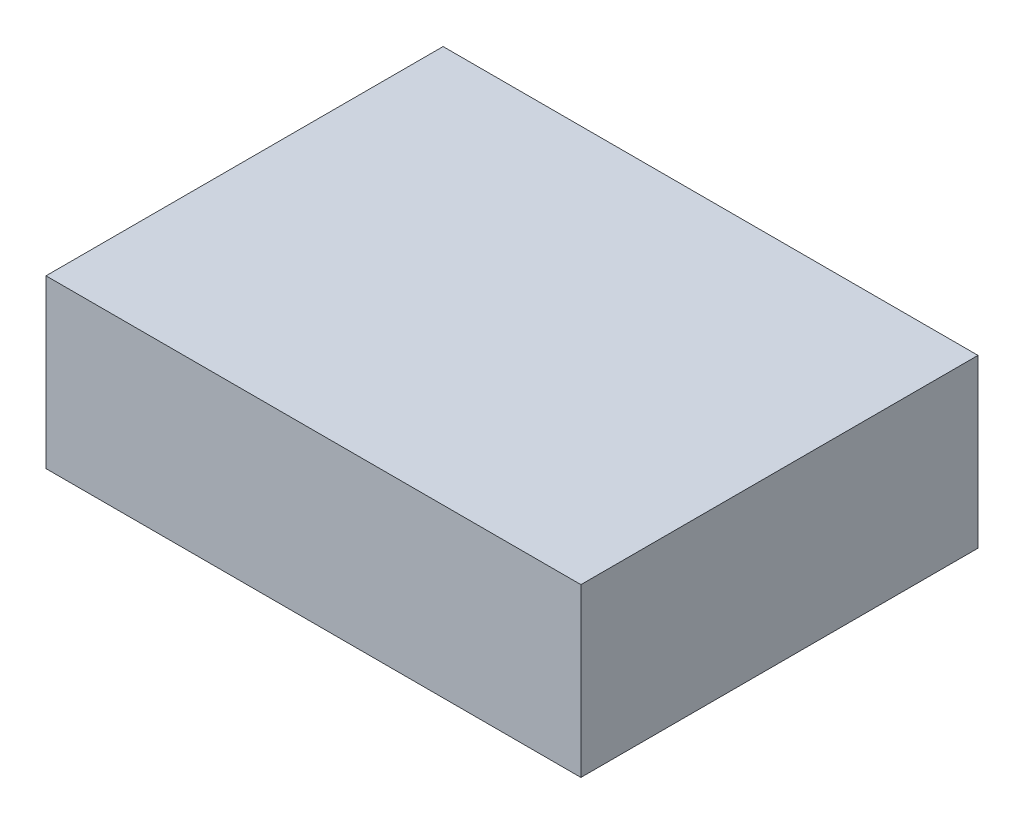
ISO-10303-21;
HEADER;
FILE_DESCRIPTION(('STEP AP214'),'2;1');
FILE_NAME('part.step','',(''),(''),'','','');
FILE_SCHEMA(('AUTOMOTIVE_DESIGN { 1 0 10303 214 1 1 1 1 }'));
ENDSEC;
DATA;
#1=APPLICATION_CONTEXT('core data for automotive mechanical design processes');
#2=APPLICATION_PROTOCOL_DEFINITION('international standard','automotive_design',2000,#1);
#3=PRODUCT_CONTEXT('',#1,'mechanical');
#4=PRODUCT('Part','Part','',(#3));
#5=PRODUCT_RELATED_PRODUCT_CATEGORY('part','',(#4));
#6=PRODUCT_DEFINITION_FORMATION('','',#4);
#7=PRODUCT_DEFINITION_CONTEXT('part definition',#1,'design');
#8=PRODUCT_DEFINITION('design','',#6,#7);
#9=PRODUCT_DEFINITION_SHAPE('','',#8);
#10=(LENGTH_UNIT() NAMED_UNIT(*) SI_UNIT(.MILLI.,.METRE.));
#11=(NAMED_UNIT(*) PLANE_ANGLE_UNIT() SI_UNIT($,.RADIAN.));
#12=(NAMED_UNIT(*) SI_UNIT($,.STERADIAN.) SOLID_ANGLE_UNIT());
#13=UNCERTAINTY_MEASURE_WITH_UNIT(LENGTH_MEASURE(1.E-05),#10,'distance_accuracy_value','');
#14=(GEOMETRIC_REPRESENTATION_CONTEXT(3) GLOBAL_UNCERTAINTY_ASSIGNED_CONTEXT((#13)) GLOBAL_UNIT_ASSIGNED_CONTEXT((#10,
#11,#12)) REPRESENTATION_CONTEXT('',''));
#15=CARTESIAN_POINT('',(0.,0.,0.));
#16=DIRECTION('',(0.,0.,1.));
#17=DIRECTION('',(1.,0.,0.));
#18=AXIS2_PLACEMENT_3D('',#15,#16,#17);
#19=CARTESIAN_POINT('',(240.223556677056,150.,178.333673413581));
#20=DIRECTION('',(-1.,0.,0.));
#21=DIRECTION('',(0.,0.,1.));
#22=AXIS2_PLACEMENT_3D('',#19,#20,#21);
#23=PLANE('',#22);
#24=DIRECTION('',(0.,0.,-1.));
#25=VECTOR('',#24,1.);
#26=CARTESIAN_POINT('',(240.223556677056,0.,178.333673413581));
#27=LINE('',#26,#25);
#28=CARTESIAN_POINT('',(240.223556677056,0.,178.333673413581));
#29=VERTEX_POINT('',#28);
#30=CARTESIAN_POINT('',(240.223556677056,0.,-178.333673413581));
#31=VERTEX_POINT('',#30);
#32=EDGE_CURVE('E107',#29,#31,#27,.T.);
#33=ORIENTED_EDGE('',*,*,#32,.T.);
#34=DIRECTION('',(0.,-1.,0.));
#35=VECTOR('',#34,1.);
#36=CARTESIAN_POINT('',(240.223556677056,150.,-178.333673413581));
#37=LINE('',#36,#35);
#38=CARTESIAN_POINT('',(240.223556677056,150.,-178.333673413581));
#39=VERTEX_POINT('',#38);
#40=EDGE_CURVE('E11',#39,#31,#37,.T.);
#41=ORIENTED_EDGE('',*,*,#40,.F.);
#42=DIRECTION('',(0.,0.,-1.));
#43=VECTOR('',#42,1.);
#44=CARTESIAN_POINT('',(240.223556677056,150.,178.333673413581));
#45=LINE('',#44,#43);
#46=CARTESIAN_POINT('',(240.223556677056,150.,178.333673413581));
#47=VERTEX_POINT('',#46);
#48=EDGE_CURVE('E91',#47,#39,#45,.T.);
#49=ORIENTED_EDGE('',*,*,#48,.F.);
#50=DIRECTION('',(0.,-1.,0.));
#51=VECTOR('',#50,1.);
#52=CARTESIAN_POINT('',(240.223556677056,150.,178.333673413581));
#53=LINE('',#52,#51);
#54=EDGE_CURVE('E103',#47,#29,#53,.T.);
#55=ORIENTED_EDGE('',*,*,#54,.T.);
#56=EDGE_LOOP('',(#33,#41,#49,#55));
#57=FACE_BOUND('',#56,.T.);
#58=ADVANCED_FACE('F39',(#57),#23,.F.);
#59=CARTESIAN_POINT('',(-240.223556677056,150.,-178.333673413581));
#60=DIRECTION('',(0.,0.,1.));
#61=DIRECTION('',(1.,0.,0.));
#62=AXIS2_PLACEMENT_3D('',#59,#60,#61);
#63=PLANE('',#62);
#64=DIRECTION('',(-1.,0.,0.));
#65=VECTOR('',#64,1.);
#66=CARTESIAN_POINT('',(-240.223556677056,0.,-178.333673413581));
#67=LINE('',#66,#65);
#68=CARTESIAN_POINT('',(-240.223556677056,0.,-178.333673413581));
#69=VERTEX_POINT('',#68);
#70=EDGE_CURVE('E96',#31,#69,#67,.T.);
#71=ORIENTED_EDGE('',*,*,#70,.T.);
#72=DIRECTION('',(0.,-1.,0.));
#73=VECTOR('',#72,1.);
#74=CARTESIAN_POINT('',(-240.223556677056,150.,-178.333673413581));
#75=LINE('',#74,#73);
#76=CARTESIAN_POINT('',(-240.223556677056,150.,-178.333673413581));
#77=VERTEX_POINT('',#76);
#78=EDGE_CURVE('E48',#77,#69,#75,.T.);
#79=ORIENTED_EDGE('',*,*,#78,.F.);
#80=DIRECTION('',(-1.,0.,0.));
#81=VECTOR('',#80,1.);
#82=CARTESIAN_POINT('',(-240.223556677056,150.,-178.333673413581));
#83=LINE('',#82,#81);
#84=EDGE_CURVE('E86',#39,#77,#83,.T.);
#85=ORIENTED_EDGE('',*,*,#84,.F.);
#86=ORIENTED_EDGE('',*,*,#40,.T.);
#87=EDGE_LOOP('',(#71,#79,#85,#86));
#88=FACE_BOUND('',#87,.T.);
#89=ADVANCED_FACE('F95',(#88),#63,.F.);
#90=CARTESIAN_POINT('',(-240.223556677056,150.,178.333673413581));
#91=DIRECTION('',(1.,0.,0.));
#92=DIRECTION('',(0.,0.,-1.));
#93=AXIS2_PLACEMENT_3D('',#90,#91,#92);
#94=PLANE('',#93);
#95=DIRECTION('',(0.,0.,1.));
#96=VECTOR('',#95,1.);
#97=CARTESIAN_POINT('',(-240.223556677056,0.,178.333673413581));
#98=LINE('',#97,#96);
#99=CARTESIAN_POINT('',(-240.223556677056,0.,178.333673413581));
#100=VERTEX_POINT('',#99);
#101=EDGE_CURVE('E73',#69,#100,#98,.T.);
#102=ORIENTED_EDGE('',*,*,#101,.T.);
#103=DIRECTION('',(0.,-1.,0.));
#104=VECTOR('',#103,1.);
#105=CARTESIAN_POINT('',(-240.223556677056,150.,178.333673413581));
#106=LINE('',#105,#104);
#107=CARTESIAN_POINT('',(-240.223556677056,150.,178.333673413581));
#108=VERTEX_POINT('',#107);
#109=EDGE_CURVE('E98',#108,#100,#106,.T.);
#110=ORIENTED_EDGE('',*,*,#109,.F.);
#111=DIRECTION('',(0.,0.,1.));
#112=VECTOR('',#111,1.);
#113=CARTESIAN_POINT('',(-240.223556677056,150.,178.333673413581));
#114=LINE('',#113,#112);
#115=EDGE_CURVE('E89',#77,#108,#114,.T.);
#116=ORIENTED_EDGE('',*,*,#115,.F.);
#117=ORIENTED_EDGE('',*,*,#78,.T.);
#118=EDGE_LOOP('',(#102,#110,#116,#117));
#119=FACE_BOUND('',#118,.T.);
#120=ADVANCED_FACE('F99',(#119),#94,.F.);
#121=CARTESIAN_POINT('',(-240.223556677056,150.,178.333673413581));
#122=DIRECTION('',(0.,0.,-1.));
#123=DIRECTION('',(-1.,0.,0.));
#124=AXIS2_PLACEMENT_3D('',#121,#122,#123);
#125=PLANE('',#124);
#126=DIRECTION('',(1.,0.,0.));
#127=VECTOR('',#126,1.);
#128=CARTESIAN_POINT('',(-240.223556677056,0.,178.333673413581));
#129=LINE('',#128,#127);
#130=EDGE_CURVE('E79',#100,#29,#129,.T.);
#131=ORIENTED_EDGE('',*,*,#130,.T.);
#132=ORIENTED_EDGE('',*,*,#54,.F.);
#133=DIRECTION('',(1.,0.,0.));
#134=VECTOR('',#133,1.);
#135=CARTESIAN_POINT('',(-240.223556677056,150.,178.333673413581));
#136=LINE('',#135,#134);
#137=EDGE_CURVE('E56',#108,#47,#136,.T.);
#138=ORIENTED_EDGE('',*,*,#137,.F.);
#139=ORIENTED_EDGE('',*,*,#109,.T.);
#140=EDGE_LOOP('',(#131,#132,#138,#139));
#141=FACE_BOUND('',#140,.T.);
#142=ADVANCED_FACE('F120',(#141),#125,.F.);
#143=CARTESIAN_POINT('',(0.,150.,0.));
#144=DIRECTION('',(0.,-1.,0.));
#145=DIRECTION('',(0.,0.,-1.));
#146=AXIS2_PLACEMENT_3D('',#143,#144,#145);
#147=PLANE('',#146);
#148=ORIENTED_EDGE('',*,*,#48,.T.);
#149=ORIENTED_EDGE('',*,*,#84,.T.);
#150=ORIENTED_EDGE('',*,*,#115,.T.);
#151=ORIENTED_EDGE('',*,*,#137,.T.);
#152=EDGE_LOOP('',(#148,#149,#150,#151));
#153=FACE_BOUND('',#152,.T.);
#154=ADVANCED_FACE('F87',(#153),#147,.F.);
#155=CARTESIAN_POINT('',(0.,0.,0.));
#156=DIRECTION('',(0.,-1.,0.));
#157=DIRECTION('',(0.,0.,-1.));
#158=AXIS2_PLACEMENT_3D('',#155,#156,#157);
#159=PLANE('',#158);
#160=ORIENTED_EDGE('',*,*,#32,.F.);
#161=ORIENTED_EDGE('',*,*,#130,.F.);
#162=ORIENTED_EDGE('',*,*,#101,.F.);
#163=ORIENTED_EDGE('',*,*,#70,.F.);
#164=EDGE_LOOP('',(#160,#161,#162,#163));
#165=FACE_BOUND('',#164,.T.);
#166=ADVANCED_FACE('F123',(#165),#159,.T.);
#167=CLOSED_SHELL('',(#58,#89,#120,#142,#154,#166));
#168=MANIFOLD_SOLID_BREP('B2',#167);
#169=ADVANCED_BREP_SHAPE_REPRESENTATION('',(#18,#168),#14);
#170=SHAPE_DEFINITION_REPRESENTATION(#9,#169);
ENDSEC;
END-ISO-10303-21;
